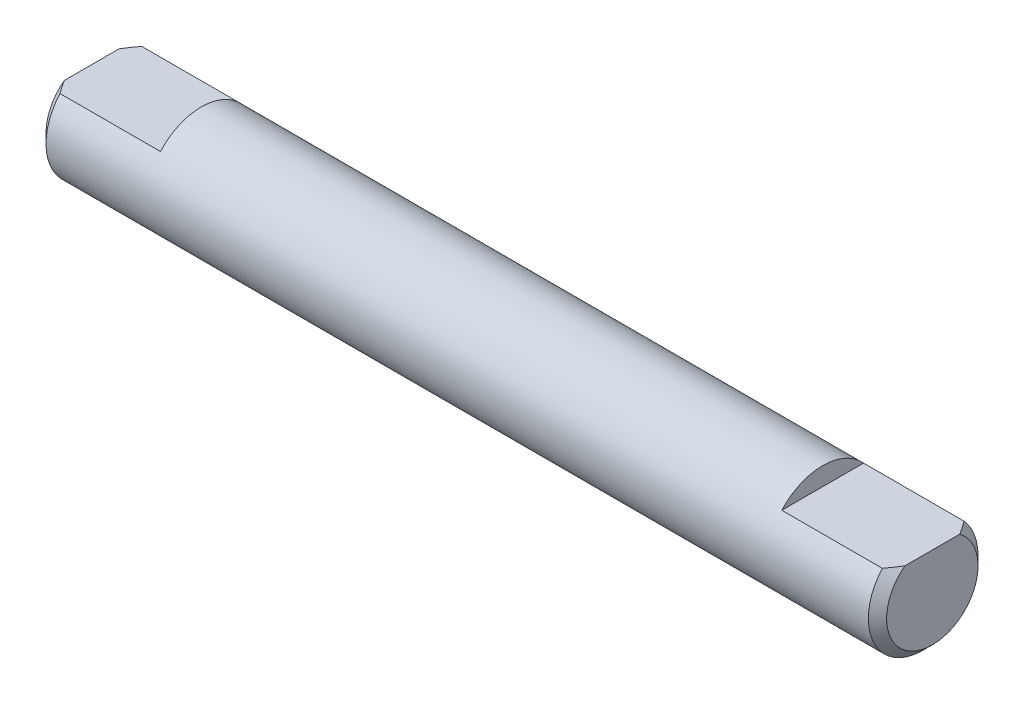
ISO-10303-21;
HEADER;
FILE_DESCRIPTION(('STEP AP214'),'2;1');
FILE_NAME('part.step','',(''),(''),'','','');
FILE_SCHEMA(('AUTOMOTIVE_DESIGN { 1 0 10303 214 1 1 1 1 }'));
ENDSEC;
DATA;
#1=APPLICATION_CONTEXT('core data for automotive mechanical design processes');
#2=APPLICATION_PROTOCOL_DEFINITION('international standard','automotive_design',2000,#1);
#3=PRODUCT_CONTEXT('',#1,'mechanical');
#4=PRODUCT('Part','Part','',(#3));
#5=PRODUCT_RELATED_PRODUCT_CATEGORY('part','',(#4));
#6=PRODUCT_DEFINITION_FORMATION('','',#4);
#7=PRODUCT_DEFINITION_CONTEXT('part definition',#1,'design');
#8=PRODUCT_DEFINITION('design','',#6,#7);
#9=PRODUCT_DEFINITION_SHAPE('','',#8);
#10=(LENGTH_UNIT() NAMED_UNIT(*) SI_UNIT(.MILLI.,.METRE.));
#11=(NAMED_UNIT(*) PLANE_ANGLE_UNIT() SI_UNIT($,.RADIAN.));
#12=(NAMED_UNIT(*) SI_UNIT($,.STERADIAN.) SOLID_ANGLE_UNIT());
#13=UNCERTAINTY_MEASURE_WITH_UNIT(LENGTH_MEASURE(1.E-05),#10,'distance_accuracy_value','');
#14=(GEOMETRIC_REPRESENTATION_CONTEXT(3) GLOBAL_UNCERTAINTY_ASSIGNED_CONTEXT((#13)) GLOBAL_UNIT_ASSIGNED_CONTEXT((#10,
#11,#12)) REPRESENTATION_CONTEXT('',''));
#15=CARTESIAN_POINT('',(0.,0.,0.));
#16=DIRECTION('',(0.,0.,1.));
#17=DIRECTION('',(1.,0.,0.));
#18=AXIS2_PLACEMENT_3D('',#15,#16,#17);
#19=CARTESIAN_POINT('',(23.,0.,0.));
#20=DIRECTION('',(-1.,0.,0.));
#21=DIRECTION('',(0.,0.,1.));
#22=AXIS2_PLACEMENT_3D('',#19,#20,#21);
#23=CYLINDRICAL_SURFACE('',#22,3.);
#24=CARTESIAN_POINT('',(22.5,0.,0.));
#25=DIRECTION('',(1.,0.,0.));
#26=DIRECTION('',(0.,0.,-1.));
#27=AXIS2_PLACEMENT_3D('',#24,#25,#26);
#28=CIRCLE('',#27,3.);
#29=CARTESIAN_POINT('',(22.5,2.,-2.23606797749979));
#30=VERTEX_POINT('',#29);
#31=CARTESIAN_POINT('',(22.5,2.,2.23606797749979));
#32=VERTEX_POINT('',#31);
#33=EDGE_CURVE('E123',#30,#32,#28,.F.);
#34=ORIENTED_EDGE('',*,*,#33,.T.);
#35=DIRECTION('',(1.,0.,0.));
#36=VECTOR('',#35,1.);
#37=CARTESIAN_POINT('',(17.,2.,2.23606797749979));
#38=LINE('',#37,#36);
#39=CARTESIAN_POINT('',(17.,2.,2.23606797749979));
#40=VERTEX_POINT('',#39);
#41=EDGE_CURVE('E118',#40,#32,#38,.T.);
#42=ORIENTED_EDGE('',*,*,#41,.F.);
#43=CARTESIAN_POINT('',(17.,0.,0.));
#44=DIRECTION('',(1.,0.,0.));
#45=DIRECTION('',(0.,0.,-1.));
#46=AXIS2_PLACEMENT_3D('',#43,#44,#45);
#47=CIRCLE('',#46,3.);
#48=CARTESIAN_POINT('',(17.,2.,-2.23606797749979));
#49=VERTEX_POINT('',#48);
#50=EDGE_CURVE('E113',#49,#40,#47,.T.);
#51=ORIENTED_EDGE('',*,*,#50,.F.);
#52=DIRECTION('',(1.,0.,0.));
#53=VECTOR('',#52,1.);
#54=CARTESIAN_POINT('',(17.,2.,-2.23606797749979));
#55=LINE('',#54,#53);
#56=EDGE_CURVE('E120',#49,#30,#55,.T.);
#57=ORIENTED_EDGE('',*,*,#56,.T.);
#58=EDGE_LOOP('',(#34,#42,#51,#57));
#59=FACE_BOUND('',#58,.T.);
#60=DIRECTION('',(-1.,0.,0.));
#61=VECTOR('',#60,1.);
#62=CARTESIAN_POINT('',(-17.,2.,-2.23606797749979));
#63=LINE('',#62,#61);
#64=CARTESIAN_POINT('',(-17.,2.,-2.23606797749979));
#65=VERTEX_POINT('',#64);
#66=CARTESIAN_POINT('',(-22.5,2.,-2.23606797749979));
#67=VERTEX_POINT('',#66);
#68=EDGE_CURVE('E57',#65,#67,#63,.T.);
#69=ORIENTED_EDGE('',*,*,#68,.F.);
#70=CARTESIAN_POINT('',(-17.,0.,0.));
#71=DIRECTION('',(1.,0.,0.));
#72=DIRECTION('',(0.,0.,-1.));
#73=AXIS2_PLACEMENT_3D('',#70,#71,#72);
#74=CIRCLE('',#73,3.);
#75=CARTESIAN_POINT('',(-17.,2.,2.23606797749979));
#76=VERTEX_POINT('',#75);
#77=EDGE_CURVE('E100',#65,#76,#74,.T.);
#78=ORIENTED_EDGE('',*,*,#77,.T.);
#79=DIRECTION('',(-1.,0.,0.));
#80=VECTOR('',#79,1.);
#81=CARTESIAN_POINT('',(-17.,2.,2.23606797749979));
#82=LINE('',#81,#80);
#83=CARTESIAN_POINT('',(-22.5,2.,2.23606797749979));
#84=VERTEX_POINT('',#83);
#85=EDGE_CURVE('E97',#76,#84,#82,.T.);
#86=ORIENTED_EDGE('',*,*,#85,.T.);
#87=CARTESIAN_POINT('',(-22.5,0.,0.));
#88=DIRECTION('',(1.,0.,0.));
#89=DIRECTION('',(0.,0.,-1.));
#90=AXIS2_PLACEMENT_3D('',#87,#88,#89);
#91=CIRCLE('',#90,3.);
#92=EDGE_CURVE('E108',#84,#67,#91,.T.);
#93=ORIENTED_EDGE('',*,*,#92,.T.);
#94=EDGE_LOOP('',(#69,#78,#86,#93));
#95=FACE_BOUND('',#94,.T.);
#96=ADVANCED_FACE('F36',(#59,#95),#23,.T.);
#97=CARTESIAN_POINT('',(-23.,0.,0.));
#98=DIRECTION('',(1.,0.,0.));
#99=DIRECTION('',(0.,0.,-1.));
#100=AXIS2_PLACEMENT_3D('',#97,#98,#99);
#101=PLANE('',#100);
#102=DIRECTION('',(0.,0.,-1.));
#103=VECTOR('',#102,1.);
#104=CARTESIAN_POINT('',(-23.,2.,2.23606797749979));
#105=LINE('',#104,#103);
#106=CARTESIAN_POINT('',(-23.,2.,1.49999999999999));
#107=VERTEX_POINT('',#106);
#108=CARTESIAN_POINT('',(-23.,2.,-1.49999999999999));
#109=VERTEX_POINT('',#108);
#110=EDGE_CURVE('E104',#107,#109,#105,.T.);
#111=ORIENTED_EDGE('',*,*,#110,.T.);
#112=CARTESIAN_POINT('',(-23.,0.,0.));
#113=DIRECTION('',(1.,0.,0.));
#114=DIRECTION('',(0.,0.,-1.));
#115=AXIS2_PLACEMENT_3D('',#112,#113,#114);
#116=CIRCLE('',#115,2.5);
#117=EDGE_CURVE('E128',#109,#107,#116,.F.);
#118=ORIENTED_EDGE('',*,*,#117,.T.);
#119=EDGE_LOOP('',(#111,#118));
#120=FACE_BOUND('',#119,.T.);
#121=ADVANCED_FACE('F151',(#120),#101,.F.);
#122=CARTESIAN_POINT('',(-22.5,0.,0.));
#123=DIRECTION('',(1.,0.,0.));
#124=DIRECTION('',(0.,0.,-1.));
#125=AXIS2_PLACEMENT_3D('',#122,#123,#124);
#126=CONICAL_SURFACE('',#125,3.,0.785398163397452);
#127=ORIENTED_EDGE('',*,*,#92,.F.);
#128=CARTESIAN_POINT('',(-20.1739562951765,2.,4.93626797749979));
#129=CARTESIAN_POINT('',(-20.3116263102323,2.,4.78768381124845));
#130=CARTESIAN_POINT('',(-20.4488688001703,2.,4.63869756596273));
#131=CARTESIAN_POINT('',(-20.7221404063521,2.,4.33955728207182));
#132=CARTESIAN_POINT('',(-20.8581692492664,2.,4.18940299398387));
#133=CARTESIAN_POINT('',(-21.1294043369861,2.,3.88672415849227));
#134=CARTESIAN_POINT('',(-21.2646007730296,2.,3.7341908006299));
#135=CARTESIAN_POINT('',(-21.5326839106298,2.,3.42713160304089));
#136=CARTESIAN_POINT('',(-21.6655708826726,2.,3.27260600039062));
#137=CARTESIAN_POINT('',(-21.9016416051834,2.,2.99210640438999));
#138=CARTESIAN_POINT('',(-22.0054251811024,2.,2.86663901089742));
#139=CARTESIAN_POINT('',(-22.2100672620052,2.,2.61328277643715));
#140=CARTESIAN_POINT('',(-22.3109250532625,2.,2.48539335700055));
#141=CARTESIAN_POINT('',(-22.5082990419047,2.,2.22650548443354));
#142=CARTESIAN_POINT('',(-22.6048202373963,2.,2.09551089088956));
#143=CARTESIAN_POINT('',(-22.7447671190917,2.,1.89566419584528));
#144=CARTESIAN_POINT('',(-22.7906025013962,2.,1.82850179908418));
#145=CARTESIAN_POINT('',(-22.8802458696183,2.,1.69284128038713));
#146=CARTESIAN_POINT('',(-22.9240540801268,2.,1.62434330762088));
#147=CARTESIAN_POINT('',(-23.0077568287426,2.,1.48797798387184));
#148=CARTESIAN_POINT('',(-23.0477316201661,2.,1.42016017631463));
#149=CARTESIAN_POINT('',(-23.124626643768,2.,1.28282423563598));
#150=CARTESIAN_POINT('',(-23.1615475696607,2.,1.21330649334523));
#151=CARTESIAN_POINT('',(-23.2314815211118,2.,1.07234023444369));
#152=CARTESIAN_POINT('',(-23.264496175163,2.,1.0008925377824));
#153=CARTESIAN_POINT('',(-23.3255401133741,2.,0.85592730514427));
#154=CARTESIAN_POINT('',(-23.3535707912893,2.,0.782410354510823));
#155=CARTESIAN_POINT('',(-23.4173281170312,2.,0.591196656014608));
#156=CARTESIAN_POINT('',(-23.44853668053,2.,0.471874440503044));
#157=CARTESIAN_POINT('',(-23.4798985537804,2.,0.290464949037767));
#158=CARTESIAN_POINT('',(-23.4877770901142,2.,0.229673626127377));
#159=CARTESIAN_POINT('',(-23.4980276880383,2.,0.107614500574353));
#160=CARTESIAN_POINT('',(-23.5004000751751,2.,0.0463467263164194));
#161=CARTESIAN_POINT('',(-23.4994876340507,2.,-0.0763197942470347));
#162=CARTESIAN_POINT('',(-23.4961865331302,2.,-0.137718411127131));
#163=CARTESIAN_POINT('',(-23.4840927327863,2.,-0.259968375583738));
#164=CARTESIAN_POINT('',(-23.4752996010043,2.,-0.320819679690591));
#165=CARTESIAN_POINT('',(-23.4526584972667,2.,-0.441758386957275));
#166=CARTESIAN_POINT('',(-23.4387947934545,2.,-0.501842803788246));
#167=CARTESIAN_POINT('',(-23.4066497947718,2.,-0.620801694696722));
#168=CARTESIAN_POINT('',(-23.3883682885415,2.,-0.679676110738205));
#169=CARTESIAN_POINT('',(-23.32353373849,2.,-0.867010178133715));
#170=CARTESIAN_POINT('',(-23.269655609127,2.,-0.992934833748156));
#171=CARTESIAN_POINT('',(-23.1498194583963,2.,-1.23892735531403));
#172=CARTESIAN_POINT('',(-23.0838370471123,2.,-1.35898276485906));
#173=CARTESIAN_POINT('',(-22.9431293700758,2.,-1.59585458502193));
#174=CARTESIAN_POINT('',(-22.8683039830242,2.,-1.71261073718885));
#175=CARTESIAN_POINT('',(-22.7133369591881,2.,-1.94233316376557));
#176=CARTESIAN_POINT('',(-22.6332002257383,2.,-2.05530279263013));
#177=CARTESIAN_POINT('',(-22.4584536139599,2.,-2.29310526083196));
#178=CARTESIAN_POINT('',(-22.3633231135208,2.,-2.4175531463146));
#179=CARTESIAN_POINT('',(-22.169770359034,2.,-2.66387185446492));
#180=CARTESIAN_POINT('',(-22.0713476398,2.,-2.78574230894003));
#181=CARTESIAN_POINT('',(-21.8720580954331,2.,-3.02764935246809));
#182=CARTESIAN_POINT('',(-21.7711891086712,2.,-3.14768415452678));
#183=CARTESIAN_POINT('',(-21.5677067244689,2.,-3.38626695152413));
#184=CARTESIAN_POINT('',(-21.4650932831408,2.,-3.50481490892545));
#185=CARTESIAN_POINT('',(-21.2645083359917,2.,-3.73393503767578));
#186=CARTESIAN_POINT('',(-21.1666110971079,2.,-3.84457235346526));
#187=CARTESIAN_POINT('',(-20.9698872405432,2.,-4.0650206650625));
#188=CARTESIAN_POINT('',(-20.8710606043089,2.,-4.17483164429524));
#189=CARTESIAN_POINT('',(-20.672861613006,2.,-4.39356418106756));
#190=CARTESIAN_POINT('',(-20.5734907230783,2.,-4.50248706778862));
#191=CARTESIAN_POINT('',(-20.3741449318645,2.,-4.71977019005837));
#192=CARTESIAN_POINT('',(-20.2741700570922,2.,-4.82813044992246));
#193=CARTESIAN_POINT('',(-20.1739562951765,2.,-4.93626797749979));
#194=B_SPLINE_CURVE_WITH_KNOTS('',3,(#128,#129,#130,#131,#132,#133,#134,#135,#136,#137,#138,
#139,#140,#141,#142,#143,#144,#145,#146,#147,#148,#149,#150,#151,#152,#153,#154,#155,#156,#157,
#158,#159,#160,#161,#162,#163,#164,#165,#166,#167,#168,#169,#170,#171,#172,#173,#174,#175,#176,
#177,#178,#179,#180,#181,#182,#183,#184,#185,#186,#187,#188,#189,#190,#191,#192,#193),
.UNSPECIFIED.,.F.,.F.,(4,2,2,2,2,2,2,2,2,2,2,2,2,2,2,2,2,2,2,2,2,2,2,2,2,2,2,2,2,2,2,2,4),(0.,
0.607683822515699,1.21550121371796,1.82695959733875,2.43834587720767,2.92679827952436,
3.41536885142092,3.90336106917609,4.14727001406463,4.39115187121073,4.62725676477006,
4.86330787673309,5.09926023157596,5.33514649886008,5.70350071953635,5.88718743593394,
6.07086329173091,6.25506684494243,6.4392849013503,6.62407942586769,6.80888279321206,
7.21864694206687,7.62924601323273,8.04504397302749,8.46046328332827,8.93031101628628,
9.40022542091196,9.87057139026386,10.3409292103109,10.7841162696073,11.2273121949651,
11.6696319276303,12.1119323824531),.UNSPECIFIED.);
#195=EDGE_CURVE('E11',#84,#107,#194,.T.);
#196=ORIENTED_EDGE('',*,*,#195,.T.);
#197=ORIENTED_EDGE('',*,*,#117,.F.);
#198=EDGE_CURVE('E41',#109,#67,#194,.T.);
#199=ORIENTED_EDGE('',*,*,#198,.T.);
#200=EDGE_LOOP('',(#127,#196,#197,#199));
#201=FACE_BOUND('',#200,.T.);
#202=ADVANCED_FACE('F149',(#201),#126,.T.);
#203=CARTESIAN_POINT('',(23.,0.,0.));
#204=DIRECTION('',(1.,0.,0.));
#205=DIRECTION('',(0.,0.,-1.));
#206=AXIS2_PLACEMENT_3D('',#203,#204,#205);
#207=PLANE('',#206);
#208=DIRECTION('',(0.,0.,-1.));
#209=VECTOR('',#208,1.);
#210=CARTESIAN_POINT('',(23.,2.,2.23606797749979));
#211=LINE('',#210,#209);
#212=CARTESIAN_POINT('',(23.,2.,1.5));
#213=VERTEX_POINT('',#212);
#214=CARTESIAN_POINT('',(23.,2.,-1.5));
#215=VERTEX_POINT('',#214);
#216=EDGE_CURVE('E65',#213,#215,#211,.T.);
#217=ORIENTED_EDGE('',*,*,#216,.F.);
#218=CARTESIAN_POINT('',(23.,0.,0.));
#219=DIRECTION('',(1.,0.,0.));
#220=DIRECTION('',(0.,0.,-1.));
#221=AXIS2_PLACEMENT_3D('',#218,#219,#220);
#222=CIRCLE('',#221,2.5);
#223=EDGE_CURVE('E131',#213,#215,#222,.T.);
#224=ORIENTED_EDGE('',*,*,#223,.T.);
#225=EDGE_LOOP('',(#217,#224));
#226=FACE_BOUND('',#225,.T.);
#227=ADVANCED_FACE('F146',(#226),#207,.T.);
#228=CARTESIAN_POINT('',(23.,0.,0.));
#229=DIRECTION('',(-1.,0.,0.));
#230=DIRECTION('',(0.,0.,1.));
#231=AXIS2_PLACEMENT_3D('',#228,#229,#230);
#232=CONICAL_SURFACE('',#231,2.5,0.785398163397445);
#233=CARTESIAN_POINT('',(20.1739562951765,2.,4.93626797749979));
#234=CARTESIAN_POINT('',(20.3116263102323,2.,4.78768381124845));
#235=CARTESIAN_POINT('',(20.4488688001702,2.,4.63869756596274));
#236=CARTESIAN_POINT('',(20.7221404063521,2.,4.33955728207182));
#237=CARTESIAN_POINT('',(20.8581692492664,2.,4.18940299398388));
#238=CARTESIAN_POINT('',(21.1294043369861,2.,3.88672415849228));
#239=CARTESIAN_POINT('',(21.2646007730296,2.,3.73419080062991));
#240=CARTESIAN_POINT('',(21.5326839106297,2.,3.4271316030409));
#241=CARTESIAN_POINT('',(21.6655708826726,2.,3.27260600039064));
#242=CARTESIAN_POINT('',(21.9016416051834,2.,2.99210640439001));
#243=CARTESIAN_POINT('',(22.0054251811024,2.,2.86663901089745));
#244=CARTESIAN_POINT('',(22.2100672620051,2.,2.61328277643719));
#245=CARTESIAN_POINT('',(22.3109250532624,2.,2.48539335700059));
#246=CARTESIAN_POINT('',(22.5082990419047,2.,2.22650548443359));
#247=CARTESIAN_POINT('',(22.6048202373962,2.,2.09551089088962));
#248=CARTESIAN_POINT('',(22.7447671190917,2.,1.89566419584535));
#249=CARTESIAN_POINT('',(22.7906025013961,2.,1.82850179908424));
#250=CARTESIAN_POINT('',(22.8802458696183,2.,1.6928412803872));
#251=CARTESIAN_POINT('',(22.9240540801268,2.,1.62434330762096));
#252=CARTESIAN_POINT('',(23.0077568287426,2.,1.48797798387191));
#253=CARTESIAN_POINT('',(23.0477316201661,2.,1.42016017631471));
#254=CARTESIAN_POINT('',(23.1246266437679,2.,1.28282423563605));
#255=CARTESIAN_POINT('',(23.1615475696606,2.,1.2133064933453));
#256=CARTESIAN_POINT('',(23.2314815211118,2.,1.07234023444376));
#257=CARTESIAN_POINT('',(23.2644961751629,2.,1.00089253778247));
#258=CARTESIAN_POINT('',(23.3255401133741,2.,0.855927305144334));
#259=CARTESIAN_POINT('',(23.3535707912893,2.,0.782410354510885));
#260=CARTESIAN_POINT('',(23.4173281170312,2.,0.591196656014668));
#261=CARTESIAN_POINT('',(23.44853668053,2.,0.471874440503104));
#262=CARTESIAN_POINT('',(23.4798985537804,2.,0.290464949037828));
#263=CARTESIAN_POINT('',(23.4877770901142,2.,0.229673626127439));
#264=CARTESIAN_POINT('',(23.4980276880384,2.,0.107614500574415));
#265=CARTESIAN_POINT('',(23.5004000751751,2.,0.046346726316481));
#266=CARTESIAN_POINT('',(23.4994876340507,2.,-0.0763197942469739));
#267=CARTESIAN_POINT('',(23.4961865331302,2.,-0.13771841112707));
#268=CARTESIAN_POINT('',(23.4840927327863,2.,-0.259968375583678));
#269=CARTESIAN_POINT('',(23.4752996010044,2.,-0.320819679690532));
#270=CARTESIAN_POINT('',(23.4526584972667,2.,-0.441758386957216));
#271=CARTESIAN_POINT('',(23.4387947934545,2.,-0.501842803788188));
#272=CARTESIAN_POINT('',(23.4066497947718,2.,-0.620801694696665));
#273=CARTESIAN_POINT('',(23.3883682885415,2.,-0.679676110738149));
#274=CARTESIAN_POINT('',(23.32353373849,2.,-0.867010178133648));
#275=CARTESIAN_POINT('',(23.2696556091271,2.,-0.992934833748078));
#276=CARTESIAN_POINT('',(23.1498194583964,2.,-1.23892735531393));
#277=CARTESIAN_POINT('',(23.0838370471123,2.,-1.35898276485895));
#278=CARTESIAN_POINT('',(22.9431293700759,2.,-1.5958545850218));
#279=CARTESIAN_POINT('',(22.8683039830243,2.,-1.71261073718871));
#280=CARTESIAN_POINT('',(22.7133369591882,2.,-1.94233316376541));
#281=CARTESIAN_POINT('',(22.6332002257384,2.,-2.05530279262996));
#282=CARTESIAN_POINT('',(22.45845361396,2.,-2.2931052608318));
#283=CARTESIAN_POINT('',(22.363323113521,2.,-2.41755314631445));
#284=CARTESIAN_POINT('',(22.1697703590341,2.,-2.66387185446479));
#285=CARTESIAN_POINT('',(22.0713476398001,2.,-2.78574230893991));
#286=CARTESIAN_POINT('',(21.8720580954332,2.,-3.02764935246798));
#287=CARTESIAN_POINT('',(21.7711891086713,2.,-3.14768415452668));
#288=CARTESIAN_POINT('',(21.5677067244689,2.,-3.38626695152405));
#289=CARTESIAN_POINT('',(21.4650932831408,2.,-3.50481490892537));
#290=CARTESIAN_POINT('',(21.2645083359917,2.,-3.73393503767572));
#291=CARTESIAN_POINT('',(21.1666110971079,2.,-3.84457235346521));
#292=CARTESIAN_POINT('',(20.9698872405432,2.,-4.06502066506245));
#293=CARTESIAN_POINT('',(20.8710606043089,2.,-4.1748316442952));
#294=CARTESIAN_POINT('',(20.672861613006,2.,-4.39356418106754));
#295=CARTESIAN_POINT('',(20.5734907230783,2.,-4.5024870677886));
#296=CARTESIAN_POINT('',(20.3741449318645,2.,-4.71977019005836));
#297=CARTESIAN_POINT('',(20.2741700570922,2.,-4.82813044992245));
#298=CARTESIAN_POINT('',(20.1739562951765,2.,-4.93626797749979));
#299=B_SPLINE_CURVE_WITH_KNOTS('',3,(#233,#234,#235,#236,#237,#238,#239,#240,#241,#242,#243,
#244,#245,#246,#247,#248,#249,#250,#251,#252,#253,#254,#255,#256,#257,#258,#259,#260,#261,#262,
#263,#264,#265,#266,#267,#268,#269,#270,#271,#272,#273,#274,#275,#276,#277,#278,#279,#280,#281,
#282,#283,#284,#285,#286,#287,#288,#289,#290,#291,#292,#293,#294,#295,#296,#297,#298),
.UNSPECIFIED.,.F.,.F.,(4,2,2,2,2,2,2,2,2,2,2,2,2,2,2,2,2,2,2,2,2,2,2,2,2,2,2,2,2,2,2,2,4),(0.,
0.607683822515695,1.21550121371795,1.82695959733874,2.43834587720766,2.92679827952434,
3.41536885142089,3.90336106917604,4.14727001406458,4.39115187121067,4.62725676477,
4.86330787673303,5.09926023157592,5.33514649886005,5.70350071953631,5.88718743593391,
6.07086329173088,6.2550668449424,6.43928490135027,6.62407942586766,6.80888279321203,
7.2186469420668,7.62924601323263,8.04504397302735,8.46046328332809,8.93031101628614,
9.40022542091185,9.87057139026379,10.3409292103109,10.7841162696073,11.2273121949651,
11.6696319276303,12.1119323824532),.UNSPECIFIED.);
#300=EDGE_CURVE('E139',#32,#213,#299,.T.);
#301=ORIENTED_EDGE('',*,*,#300,.F.);
#302=ORIENTED_EDGE('',*,*,#33,.F.);
#303=EDGE_CURVE('E133',#215,#30,#299,.T.);
#304=ORIENTED_EDGE('',*,*,#303,.F.);
#305=ORIENTED_EDGE('',*,*,#223,.F.);
#306=EDGE_LOOP('',(#301,#302,#304,#305));
#307=FACE_BOUND('',#306,.T.);
#308=ADVANCED_FACE('F38',(#307),#232,.T.);
#309=CARTESIAN_POINT('',(17.,2.,2.23606797749979));
#310=DIRECTION('',(0.,-1.,0.));
#311=DIRECTION('',(0.,0.,-1.));
#312=AXIS2_PLACEMENT_3D('',#309,#310,#311);
#313=PLANE('',#312);
#314=ORIENTED_EDGE('',*,*,#300,.T.);
#315=ORIENTED_EDGE('',*,*,#216,.T.);
#316=ORIENTED_EDGE('',*,*,#303,.T.);
#317=ORIENTED_EDGE('',*,*,#56,.F.);
#318=DIRECTION('',(0.,0.,-1.));
#319=VECTOR('',#318,1.);
#320=CARTESIAN_POINT('',(17.,2.,2.23606797749979));
#321=LINE('',#320,#319);
#322=EDGE_CURVE('E115',#40,#49,#321,.T.);
#323=ORIENTED_EDGE('',*,*,#322,.F.);
#324=ORIENTED_EDGE('',*,*,#41,.T.);
#325=EDGE_LOOP('',(#314,#315,#316,#317,#323,#324));
#326=FACE_BOUND('',#325,.T.);
#327=ADVANCED_FACE('F140',(#326),#313,.F.);
#328=CARTESIAN_POINT('',(17.,0.,0.));
#329=DIRECTION('',(1.,0.,0.));
#330=DIRECTION('',(0.,0.,-1.));
#331=AXIS2_PLACEMENT_3D('',#328,#329,#330);
#332=PLANE('',#331);
#333=ORIENTED_EDGE('',*,*,#50,.T.);
#334=ORIENTED_EDGE('',*,*,#322,.T.);
#335=EDGE_LOOP('',(#333,#334));
#336=FACE_BOUND('',#335,.T.);
#337=ADVANCED_FACE('F145',(#336),#332,.T.);
#338=CARTESIAN_POINT('',(-17.,2.,2.23606797749979));
#339=DIRECTION('',(0.,1.,0.));
#340=DIRECTION('',(0.,0.,1.));
#341=AXIS2_PLACEMENT_3D('',#338,#339,#340);
#342=PLANE('',#341);
#343=ORIENTED_EDGE('',*,*,#85,.F.);
#344=DIRECTION('',(0.,0.,-1.));
#345=VECTOR('',#344,1.);
#346=CARTESIAN_POINT('',(-17.,2.,2.23606797749979));
#347=LINE('',#346,#345);
#348=EDGE_CURVE('E93',#76,#65,#347,.T.);
#349=ORIENTED_EDGE('',*,*,#348,.T.);
#350=ORIENTED_EDGE('',*,*,#68,.T.);
#351=ORIENTED_EDGE('',*,*,#198,.F.);
#352=ORIENTED_EDGE('',*,*,#110,.F.);
#353=ORIENTED_EDGE('',*,*,#195,.F.);
#354=EDGE_LOOP('',(#343,#349,#350,#351,#352,#353));
#355=FACE_BOUND('',#354,.T.);
#356=ADVANCED_FACE('F95',(#355),#342,.T.);
#357=CARTESIAN_POINT('',(-17.,0.,0.));
#358=DIRECTION('',(-1.,0.,0.));
#359=DIRECTION('',(0.,0.,-1.));
#360=AXIS2_PLACEMENT_3D('',#357,#358,#359);
#361=PLANE('',#360);
#362=ORIENTED_EDGE('',*,*,#77,.F.);
#363=ORIENTED_EDGE('',*,*,#348,.F.);
#364=EDGE_LOOP('',(#362,#363));
#365=FACE_BOUND('',#364,.T.);
#366=ADVANCED_FACE('F102',(#365),#361,.T.);
#367=CLOSED_SHELL('',(#96,#121,#202,#227,#308,#327,#337,#356,#366));
#368=MANIFOLD_SOLID_BREP('B2',#367);
#369=ADVANCED_BREP_SHAPE_REPRESENTATION('',(#18,#368),#14);
#370=SHAPE_DEFINITION_REPRESENTATION(#9,#369);
ENDSEC;
END-ISO-10303-21;
